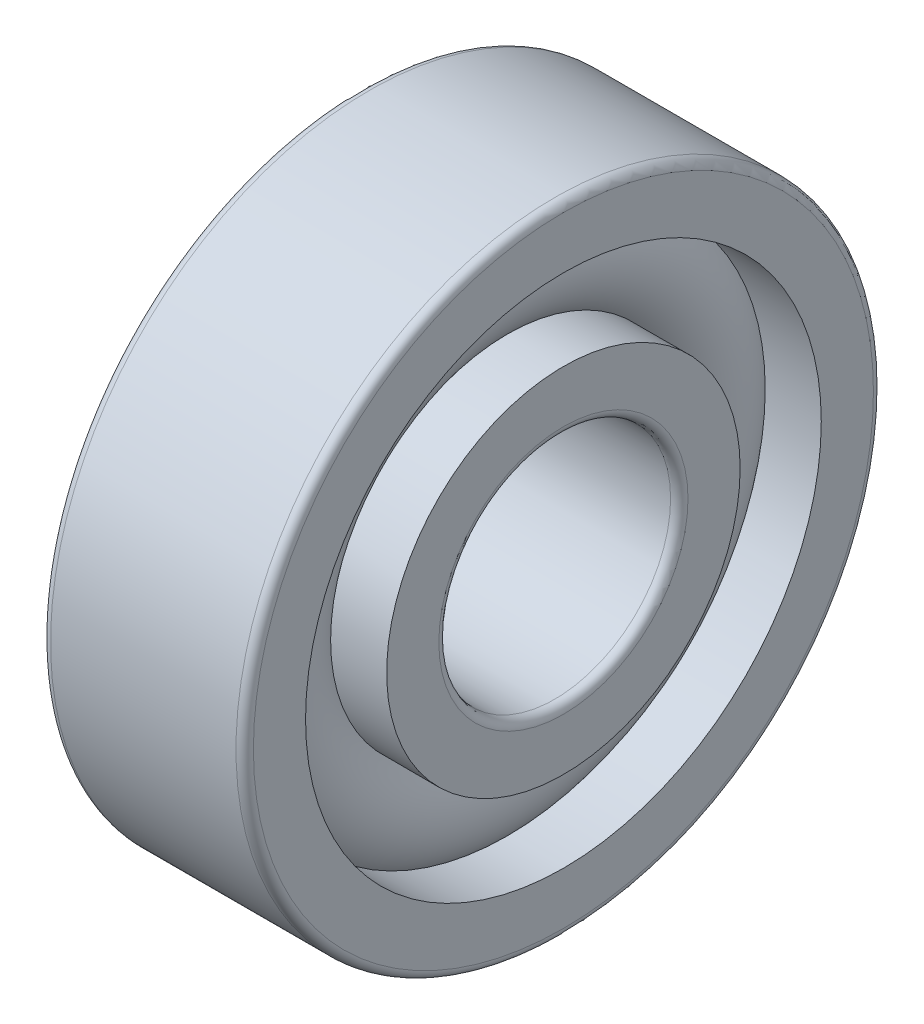
ISO-10303-21;
HEADER;
FILE_DESCRIPTION(('STEP AP214'),'2;1');
FILE_NAME('part.step','',(''),(''),'','','');
FILE_SCHEMA(('AUTOMOTIVE_DESIGN { 1 0 10303 214 1 1 1 1 }'));
ENDSEC;
DATA;
#1=APPLICATION_CONTEXT('core data for automotive mechanical design processes');
#2=APPLICATION_PROTOCOL_DEFINITION('international standard','automotive_design',2000,#1);
#3=PRODUCT_CONTEXT('',#1,'mechanical');
#4=PRODUCT('Part','Part','',(#3));
#5=PRODUCT_RELATED_PRODUCT_CATEGORY('part','',(#4));
#6=PRODUCT_DEFINITION_FORMATION('','',#4);
#7=PRODUCT_DEFINITION_CONTEXT('part definition',#1,'design');
#8=PRODUCT_DEFINITION('design','',#6,#7);
#9=PRODUCT_DEFINITION_SHAPE('','',#8);
#10=(LENGTH_UNIT() NAMED_UNIT(*) SI_UNIT(.MILLI.,.METRE.));
#11=(NAMED_UNIT(*) PLANE_ANGLE_UNIT() SI_UNIT($,.RADIAN.));
#12=(NAMED_UNIT(*) SI_UNIT($,.STERADIAN.) SOLID_ANGLE_UNIT());
#13=UNCERTAINTY_MEASURE_WITH_UNIT(LENGTH_MEASURE(1.E-05),#10,'distance_accuracy_value','');
#14=(GEOMETRIC_REPRESENTATION_CONTEXT(3) GLOBAL_UNCERTAINTY_ASSIGNED_CONTEXT((#13)) GLOBAL_UNIT_ASSIGNED_CONTEXT((#10,
#11,#12)) REPRESENTATION_CONTEXT('',''));
#15=CARTESIAN_POINT('',(0.,0.,0.));
#16=DIRECTION('',(0.,0.,1.));
#17=DIRECTION('',(1.,0.,0.));
#18=AXIS2_PLACEMENT_3D('',#15,#16,#17);
#19=CARTESIAN_POINT('',(0.,0.,0.));
#20=DIRECTION('',(-1.,0.,0.));
#21=DIRECTION('',(0.,0.,1.));
#22=AXIS2_PLACEMENT_3D('',#19,#20,#21);
#23=TOROIDAL_SURFACE('',#22,7.5,2.1);
#24=CARTESIAN_POINT('',(1.56524758424985,0.,0.));
#25=DIRECTION('',(-1.,0.,0.));
#26=DIRECTION('',(0.,0.,1.));
#27=AXIS2_PLACEMENT_3D('',#24,#25,#26);
#28=CIRCLE('',#27,8.90000000000001);
#29=CARTESIAN_POINT('',(1.56524758424985,0.,8.90000000000001));
#30=VERTEX_POINT('',#29);
#31=EDGE_CURVE('E41',#30,#30,#28,.F.);
#32=ORIENTED_EDGE('',*,*,#31,.T.);
#33=EDGE_LOOP('',(#32));
#34=FACE_BOUND('',#33,.T.);
#35=CARTESIAN_POINT('',(1.56524758424985,0.,0.));
#36=DIRECTION('',(-1.,0.,0.));
#37=DIRECTION('',(0.,0.,1.));
#38=AXIS2_PLACEMENT_3D('',#35,#36,#37);
#39=CIRCLE('',#38,6.1);
#40=CARTESIAN_POINT('',(1.56524758424985,0.,6.1));
#41=VERTEX_POINT('',#40);
#42=EDGE_CURVE('E10',#41,#41,#39,.T.);
#43=ORIENTED_EDGE('',*,*,#42,.T.);
#44=EDGE_LOOP('',(#43));
#45=FACE_BOUND('',#44,.T.);
#46=ADVANCED_FACE('F37',(#34,#45),#23,.T.);
#47=CARTESIAN_POINT('',(-20.6375,0.,0.));
#48=DIRECTION('',(1.,0.,0.));
#49=DIRECTION('',(0.,0.,-1.));
#50=AXIS2_PLACEMENT_3D('',#47,#48,#49);
#51=CYLINDRICAL_SURFACE('',#50,6.1);
#52=CARTESIAN_POINT('',(3.5,0.,0.));
#53=DIRECTION('',(1.,0.,0.));
#54=DIRECTION('',(0.,0.,-1.));
#55=AXIS2_PLACEMENT_3D('',#52,#53,#54);
#56=CIRCLE('',#55,6.1);
#57=CARTESIAN_POINT('',(3.5,0.,-6.1));
#58=VERTEX_POINT('',#57);
#59=EDGE_CURVE('E50',#58,#58,#56,.T.);
#60=ORIENTED_EDGE('',*,*,#59,.F.);
#61=EDGE_LOOP('',(#60));
#62=FACE_BOUND('',#61,.T.);
#63=ORIENTED_EDGE('',*,*,#42,.F.);
#64=EDGE_LOOP('',(#63));
#65=FACE_BOUND('',#64,.T.);
#66=ADVANCED_FACE('F89',(#62,#65),#51,.T.);
#67=CARTESIAN_POINT('',(-20.6375,0.,0.));
#68=DIRECTION('',(1.,0.,0.));
#69=DIRECTION('',(0.,0.,-1.));
#70=AXIS2_PLACEMENT_3D('',#67,#68,#69);
#71=CYLINDRICAL_SURFACE('',#70,6.1);
#72=CARTESIAN_POINT('',(-3.5,0.,0.));
#73=DIRECTION('',(1.,0.,0.));
#74=DIRECTION('',(0.,0.,-1.));
#75=AXIS2_PLACEMENT_3D('',#72,#73,#74);
#76=CIRCLE('',#75,6.1);
#77=CARTESIAN_POINT('',(-3.5,0.,-6.1));
#78=VERTEX_POINT('',#77);
#79=EDGE_CURVE('E59',#78,#78,#76,.T.);
#80=ORIENTED_EDGE('',*,*,#79,.T.);
#81=EDGE_LOOP('',(#80));
#82=FACE_BOUND('',#81,.T.);
#83=CARTESIAN_POINT('',(-1.56524758424985,0.,0.));
#84=DIRECTION('',(1.,0.,0.));
#85=DIRECTION('',(0.,0.,-1.));
#86=AXIS2_PLACEMENT_3D('',#83,#84,#85);
#87=CIRCLE('',#86,6.1);
#88=CARTESIAN_POINT('',(-1.56524758424985,0.,-6.1));
#89=VERTEX_POINT('',#88);
#90=EDGE_CURVE('E45',#89,#89,#87,.T.);
#91=ORIENTED_EDGE('',*,*,#90,.F.);
#92=EDGE_LOOP('',(#91));
#93=FACE_BOUND('',#92,.T.);
#94=ADVANCED_FACE('F92',(#82,#93),#71,.T.);
#95=CARTESIAN_POINT('',(3.5,4.3,0.));
#96=DIRECTION('',(1.,0.,0.));
#97=DIRECTION('',(0.,0.,-1.));
#98=AXIS2_PLACEMENT_3D('',#95,#96,#97);
#99=PLANE('',#98);
#100=ORIENTED_EDGE('',*,*,#59,.T.);
#101=EDGE_LOOP('',(#100));
#102=FACE_BOUND('',#101,.T.);
#103=CARTESIAN_POINT('',(3.5,0.,0.));
#104=DIRECTION('',(1.,0.,0.));
#105=DIRECTION('',(0.,0.,-1.));
#106=AXIS2_PLACEMENT_3D('',#103,#104,#105);
#107=CIRCLE('',#106,4.3);
#108=CARTESIAN_POINT('',(3.5,0.,-4.3));
#109=VERTEX_POINT('',#108);
#110=EDGE_CURVE('E81',#109,#109,#107,.T.);
#111=ORIENTED_EDGE('',*,*,#110,.F.);
#112=EDGE_LOOP('',(#111));
#113=FACE_BOUND('',#112,.T.);
#114=ADVANCED_FACE('F86',(#102,#113),#99,.T.);
#115=CARTESIAN_POINT('',(3.2,0.,0.));
#116=DIRECTION('',(1.,0.,0.));
#117=DIRECTION('',(0.,0.,-1.));
#118=AXIS2_PLACEMENT_3D('',#115,#116,#117);
#119=TOROIDAL_SURFACE('',#118,4.3,0.299999999999999);
#120=ORIENTED_EDGE('',*,*,#110,.T.);
#121=EDGE_LOOP('',(#120));
#122=FACE_BOUND('',#121,.T.);
#123=CARTESIAN_POINT('',(3.2,0.,0.));
#124=DIRECTION('',(1.,0.,0.));
#125=DIRECTION('',(0.,0.,-1.));
#126=AXIS2_PLACEMENT_3D('',#123,#124,#125);
#127=CIRCLE('',#126,4.);
#128=CARTESIAN_POINT('',(3.2,0.,-4.));
#129=VERTEX_POINT('',#128);
#130=EDGE_CURVE('E78',#129,#129,#127,.T.);
#131=ORIENTED_EDGE('',*,*,#130,.F.);
#132=EDGE_LOOP('',(#131));
#133=FACE_BOUND('',#132,.T.);
#134=ADVANCED_FACE('F103',(#122,#133),#119,.T.);
#135=CARTESIAN_POINT('',(-20.6375,0.,0.));
#136=DIRECTION('',(1.,0.,0.));
#137=DIRECTION('',(0.,0.,-1.));
#138=AXIS2_PLACEMENT_3D('',#135,#136,#137);
#139=CYLINDRICAL_SURFACE('',#138,4.);
#140=ORIENTED_EDGE('',*,*,#130,.T.);
#141=EDGE_LOOP('',(#140));
#142=FACE_BOUND('',#141,.T.);
#143=CARTESIAN_POINT('',(-3.2,0.,0.));
#144=DIRECTION('',(1.,0.,0.));
#145=DIRECTION('',(0.,0.,-1.));
#146=AXIS2_PLACEMENT_3D('',#143,#144,#145);
#147=CIRCLE('',#146,4.);
#148=CARTESIAN_POINT('',(-3.2,0.,-4.));
#149=VERTEX_POINT('',#148);
#150=EDGE_CURVE('E75',#149,#149,#147,.T.);
#151=ORIENTED_EDGE('',*,*,#150,.F.);
#152=EDGE_LOOP('',(#151));
#153=FACE_BOUND('',#152,.T.);
#154=ADVANCED_FACE('F106',(#142,#153),#139,.F.);
#155=CARTESIAN_POINT('',(-3.2,0.,0.));
#156=DIRECTION('',(1.,0.,0.));
#157=DIRECTION('',(0.,0.,-1.));
#158=AXIS2_PLACEMENT_3D('',#155,#156,#157);
#159=TOROIDAL_SURFACE('',#158,4.3,0.299999999999999);
#160=ORIENTED_EDGE('',*,*,#150,.T.);
#161=EDGE_LOOP('',(#160));
#162=FACE_BOUND('',#161,.T.);
#163=CARTESIAN_POINT('',(-3.5,0.,0.));
#164=DIRECTION('',(1.,0.,0.));
#165=DIRECTION('',(0.,0.,-1.));
#166=AXIS2_PLACEMENT_3D('',#163,#164,#165);
#167=CIRCLE('',#166,4.3);
#168=CARTESIAN_POINT('',(-3.5,0.,-4.3));
#169=VERTEX_POINT('',#168);
#170=EDGE_CURVE('E72',#169,#169,#167,.T.);
#171=ORIENTED_EDGE('',*,*,#170,.F.);
#172=EDGE_LOOP('',(#171));
#173=FACE_BOUND('',#172,.T.);
#174=ADVANCED_FACE('F110',(#162,#173),#159,.T.);
#175=CARTESIAN_POINT('',(-3.5,6.1,0.));
#176=DIRECTION('',(-1.,0.,0.));
#177=DIRECTION('',(0.,0.,1.));
#178=AXIS2_PLACEMENT_3D('',#175,#176,#177);
#179=PLANE('',#178);
#180=ORIENTED_EDGE('',*,*,#170,.T.);
#181=EDGE_LOOP('',(#180));
#182=FACE_BOUND('',#181,.T.);
#183=ORIENTED_EDGE('',*,*,#79,.F.);
#184=EDGE_LOOP('',(#183));
#185=FACE_BOUND('',#184,.T.);
#186=ADVANCED_FACE('F114',(#182,#185),#179,.T.);
#187=CARTESIAN_POINT('',(-1.56524758424985,0.,0.));
#188=DIRECTION('',(1.,0.,0.));
#189=DIRECTION('',(0.,0.,-1.));
#190=AXIS2_PLACEMENT_3D('',#187,#188,#189);
#191=CIRCLE('',#190,8.90000000000001);
#192=CARTESIAN_POINT('',(-1.56524758424985,0.,-8.90000000000001));
#193=VERTEX_POINT('',#192);
#194=EDGE_CURVE('E53',#193,#193,#191,.F.);
#195=ORIENTED_EDGE('',*,*,#194,.T.);
#196=EDGE_LOOP('',(#195));
#197=FACE_BOUND('',#196,.T.);
#198=ORIENTED_EDGE('',*,*,#90,.T.);
#199=EDGE_LOOP('',(#198));
#200=FACE_BOUND('',#199,.T.);
#201=ADVANCED_FACE('F39',(#197,#200),#23,.T.);
#202=CARTESIAN_POINT('',(-20.6375,0.,0.));
#203=DIRECTION('',(1.,0.,0.));
#204=DIRECTION('',(0.,0.,-1.));
#205=AXIS2_PLACEMENT_3D('',#202,#203,#204);
#206=CYLINDRICAL_SURFACE('',#205,8.90000000000001);
#207=CARTESIAN_POINT('',(3.5,0.,0.));
#208=DIRECTION('',(1.,0.,0.));
#209=DIRECTION('',(0.,0.,-1.));
#210=AXIS2_PLACEMENT_3D('',#207,#208,#209);
#211=CIRCLE('',#210,8.90000000000001);
#212=CARTESIAN_POINT('',(3.5,0.,-8.90000000000001));
#213=VERTEX_POINT('',#212);
#214=EDGE_CURVE('E55',#213,#213,#211,.T.);
#215=ORIENTED_EDGE('',*,*,#214,.T.);
#216=EDGE_LOOP('',(#215));
#217=FACE_BOUND('',#216,.T.);
#218=ORIENTED_EDGE('',*,*,#31,.F.);
#219=EDGE_LOOP('',(#218));
#220=FACE_BOUND('',#219,.T.);
#221=ADVANCED_FACE('F119',(#217,#220),#206,.F.);
#222=CARTESIAN_POINT('',(-20.6375,0.,0.));
#223=DIRECTION('',(1.,0.,0.));
#224=DIRECTION('',(0.,0.,-1.));
#225=AXIS2_PLACEMENT_3D('',#222,#223,#224);
#226=CYLINDRICAL_SURFACE('',#225,8.90000000000001);
#227=CARTESIAN_POINT('',(-3.5,0.,0.));
#228=DIRECTION('',(1.,0.,0.));
#229=DIRECTION('',(0.,0.,-1.));
#230=AXIS2_PLACEMENT_3D('',#227,#228,#229);
#231=CIRCLE('',#230,8.90000000000001);
#232=CARTESIAN_POINT('',(-3.5,0.,-8.90000000000001));
#233=VERTEX_POINT('',#232);
#234=EDGE_CURVE('E150',#233,#233,#231,.T.);
#235=ORIENTED_EDGE('',*,*,#234,.F.);
#236=EDGE_LOOP('',(#235));
#237=FACE_BOUND('',#236,.T.);
#238=ORIENTED_EDGE('',*,*,#194,.F.);
#239=EDGE_LOOP('',(#238));
#240=FACE_BOUND('',#239,.T.);
#241=ADVANCED_FACE('F122',(#237,#240),#226,.F.);
#242=CARTESIAN_POINT('',(3.5,10.7,0.));
#243=DIRECTION('',(1.,0.,0.));
#244=DIRECTION('',(0.,0.,-1.));
#245=AXIS2_PLACEMENT_3D('',#242,#243,#244);
#246=PLANE('',#245);
#247=CARTESIAN_POINT('',(3.5,0.,0.));
#248=DIRECTION('',(1.,0.,0.));
#249=DIRECTION('',(0.,0.,-1.));
#250=AXIS2_PLACEMENT_3D('',#247,#248,#249);
#251=CIRCLE('',#250,10.7);
#252=CARTESIAN_POINT('',(3.5,0.,-10.7));
#253=VERTEX_POINT('',#252);
#254=EDGE_CURVE('E61',#253,#253,#251,.T.);
#255=ORIENTED_EDGE('',*,*,#254,.T.);
#256=EDGE_LOOP('',(#255));
#257=FACE_BOUND('',#256,.T.);
#258=ORIENTED_EDGE('',*,*,#214,.F.);
#259=EDGE_LOOP('',(#258));
#260=FACE_BOUND('',#259,.T.);
#261=ADVANCED_FACE('F123',(#257,#260),#246,.T.);
#262=CARTESIAN_POINT('',(3.2,0.,0.));
#263=DIRECTION('',(1.,0.,0.));
#264=DIRECTION('',(0.,0.,-1.));
#265=AXIS2_PLACEMENT_3D('',#262,#263,#264);
#266=TOROIDAL_SURFACE('',#265,10.7,0.299999999999998);
#267=CARTESIAN_POINT('',(3.2,0.,0.));
#268=DIRECTION('',(1.,0.,0.));
#269=DIRECTION('',(0.,0.,-1.));
#270=AXIS2_PLACEMENT_3D('',#267,#268,#269);
#271=CIRCLE('',#270,11.);
#272=CARTESIAN_POINT('',(3.2,0.,-11.));
#273=VERTEX_POINT('',#272);
#274=EDGE_CURVE('E66',#273,#273,#271,.T.);
#275=ORIENTED_EDGE('',*,*,#274,.T.);
#276=EDGE_LOOP('',(#275));
#277=FACE_BOUND('',#276,.T.);
#278=ORIENTED_EDGE('',*,*,#254,.F.);
#279=EDGE_LOOP('',(#278));
#280=FACE_BOUND('',#279,.T.);
#281=ADVANCED_FACE('F126',(#277,#280),#266,.T.);
#282=CARTESIAN_POINT('',(-20.6375,0.,0.));
#283=DIRECTION('',(1.,0.,0.));
#284=DIRECTION('',(0.,0.,-1.));
#285=AXIS2_PLACEMENT_3D('',#282,#283,#284);
#286=CYLINDRICAL_SURFACE('',#285,11.);
#287=CARTESIAN_POINT('',(-3.2,0.,0.));
#288=DIRECTION('',(1.,0.,0.));
#289=DIRECTION('',(0.,0.,-1.));
#290=AXIS2_PLACEMENT_3D('',#287,#288,#289);
#291=CIRCLE('',#290,11.);
#292=CARTESIAN_POINT('',(-3.2,0.,-11.));
#293=VERTEX_POINT('',#292);
#294=EDGE_CURVE('E154',#293,#293,#291,.T.);
#295=ORIENTED_EDGE('',*,*,#294,.T.);
#296=EDGE_LOOP('',(#295));
#297=FACE_BOUND('',#296,.T.);
#298=ORIENTED_EDGE('',*,*,#274,.F.);
#299=EDGE_LOOP('',(#298));
#300=FACE_BOUND('',#299,.T.);
#301=ADVANCED_FACE('F130',(#297,#300),#286,.T.);
#302=CARTESIAN_POINT('',(-3.2,0.,0.));
#303=DIRECTION('',(1.,0.,0.));
#304=DIRECTION('',(0.,0.,-1.));
#305=AXIS2_PLACEMENT_3D('',#302,#303,#304);
#306=TOROIDAL_SURFACE('',#305,10.7,0.299999999999998);
#307=CARTESIAN_POINT('',(-3.5,0.,0.));
#308=DIRECTION('',(1.,0.,0.));
#309=DIRECTION('',(0.,0.,-1.));
#310=AXIS2_PLACEMENT_3D('',#307,#308,#309);
#311=CIRCLE('',#310,10.7);
#312=CARTESIAN_POINT('',(-3.5,0.,-10.7));
#313=VERTEX_POINT('',#312);
#314=EDGE_CURVE('E151',#313,#313,#311,.T.);
#315=ORIENTED_EDGE('',*,*,#314,.T.);
#316=EDGE_LOOP('',(#315));
#317=FACE_BOUND('',#316,.T.);
#318=ORIENTED_EDGE('',*,*,#294,.F.);
#319=EDGE_LOOP('',(#318));
#320=FACE_BOUND('',#319,.T.);
#321=ADVANCED_FACE('F134',(#317,#320),#306,.T.);
#322=CARTESIAN_POINT('',(-3.5,8.90000000000001,0.));
#323=DIRECTION('',(-1.,0.,0.));
#324=DIRECTION('',(0.,0.,1.));
#325=AXIS2_PLACEMENT_3D('',#322,#323,#324);
#326=PLANE('',#325);
#327=ORIENTED_EDGE('',*,*,#234,.T.);
#328=EDGE_LOOP('',(#327));
#329=FACE_BOUND('',#328,.T.);
#330=ORIENTED_EDGE('',*,*,#314,.F.);
#331=EDGE_LOOP('',(#330));
#332=FACE_BOUND('',#331,.T.);
#333=ADVANCED_FACE('F138',(#329,#332),#326,.T.);
#334=CLOSED_SHELL('',(#46,#66,#94,#114,#134,#154,#174,#186,#201,#221,#241,#261,#281,#301,#321,#333));
#335=MANIFOLD_SOLID_BREP('B2',#334);
#336=ADVANCED_BREP_SHAPE_REPRESENTATION('',(#18,#335),#14);
#337=SHAPE_DEFINITION_REPRESENTATION(#9,#336);
ENDSEC;
END-ISO-10303-21;
